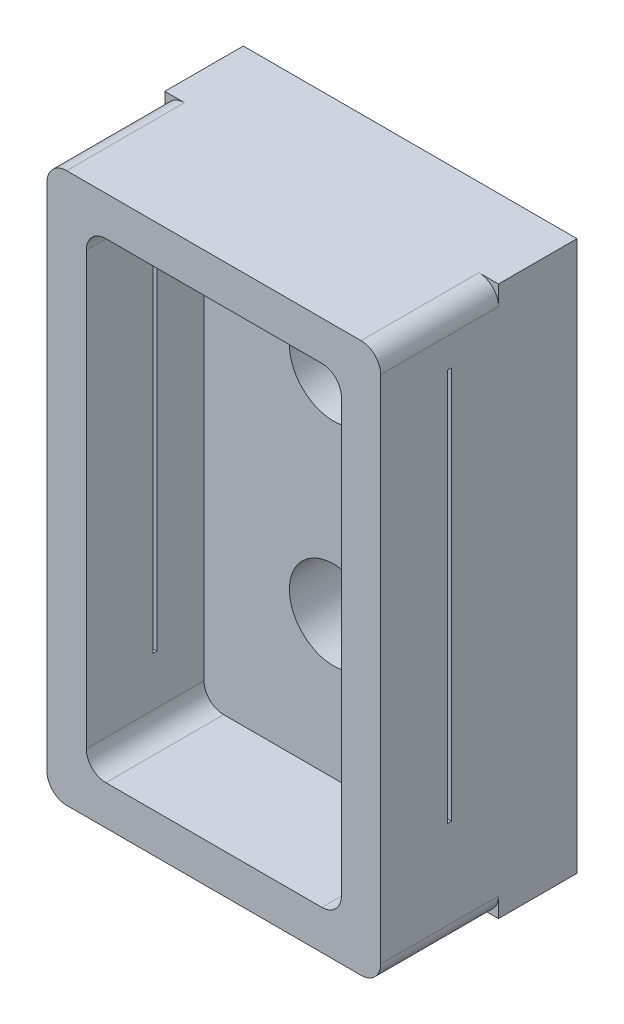
ISO-10303-21;
HEADER;
FILE_DESCRIPTION(('STEP AP214'),'2;1');
FILE_NAME('part.step','',(''),(''),'','','');
FILE_SCHEMA(('AUTOMOTIVE_DESIGN { 1 0 10303 214 1 1 1 1 }'));
ENDSEC;
DATA;
#1=APPLICATION_CONTEXT('core data for automotive mechanical design processes');
#2=APPLICATION_PROTOCOL_DEFINITION('international standard','automotive_design',2000,#1);
#3=PRODUCT_CONTEXT('',#1,'mechanical');
#4=PRODUCT('Part','Part','',(#3));
#5=PRODUCT_RELATED_PRODUCT_CATEGORY('part','',(#4));
#6=PRODUCT_DEFINITION_FORMATION('','',#4);
#7=PRODUCT_DEFINITION_CONTEXT('part definition',#1,'design');
#8=PRODUCT_DEFINITION('design','',#6,#7);
#9=PRODUCT_DEFINITION_SHAPE('','',#8);
#10=(LENGTH_UNIT() NAMED_UNIT(*) SI_UNIT(.MILLI.,.METRE.));
#11=(NAMED_UNIT(*) PLANE_ANGLE_UNIT() SI_UNIT($,.RADIAN.));
#12=(NAMED_UNIT(*) SI_UNIT($,.STERADIAN.) SOLID_ANGLE_UNIT());
#13=UNCERTAINTY_MEASURE_WITH_UNIT(LENGTH_MEASURE(1.E-05),#10,'distance_accuracy_value','');
#14=(GEOMETRIC_REPRESENTATION_CONTEXT(3) GLOBAL_UNCERTAINTY_ASSIGNED_CONTEXT((#13)) GLOBAL_UNIT_ASSIGNED_CONTEXT((#10,
#11,#12)) REPRESENTATION_CONTEXT('',''));
#15=CARTESIAN_POINT('',(0.,0.,0.));
#16=DIRECTION('',(0.,0.,1.));
#17=DIRECTION('',(1.,0.,0.));
#18=AXIS2_PLACEMENT_3D('',#15,#16,#17);
#19=CARTESIAN_POINT('',(-9.525,-20.291399463807,12.7));
#20=DIRECTION('',(1.,0.,0.));
#21=DIRECTION('',(0.,0.,-1.));
#22=AXIS2_PLACEMENT_3D('',#19,#20,#21);
#23=PLANE('',#22);
#24=DIRECTION('',(0.,0.,-1.));
#25=VECTOR('',#24,1.);
#26=CARTESIAN_POINT('',(-9.525,13.998600536193,12.7));
#27=LINE('',#26,#25);
#28=CARTESIAN_POINT('',(-9.525,13.998600536193,12.7));
#29=VERTEX_POINT('',#28);
#30=CARTESIAN_POINT('',(-9.525,13.998600536193,5.08));
#31=VERTEX_POINT('',#30);
#32=EDGE_CURVE('E377',#29,#31,#27,.T.);
#33=ORIENTED_EDGE('',*,*,#32,.T.);
#34=DIRECTION('',(0.,-1.,0.));
#35=VECTOR('',#34,1.);
#36=CARTESIAN_POINT('',(-9.525,-20.291399463807,5.08));
#37=LINE('',#36,#35);
#38=CARTESIAN_POINT('',(-9.525,15.268600536193,5.08));
#39=VERTEX_POINT('',#38);
#40=EDGE_CURVE('E241',#39,#31,#37,.T.);
#41=ORIENTED_EDGE('',*,*,#40,.F.);
#42=DIRECTION('',(0.,0.,-1.));
#43=VECTOR('',#42,1.);
#44=CARTESIAN_POINT('',(-9.525,15.268600536193,5.08));
#45=LINE('',#44,#43);
#46=CARTESIAN_POINT('',(-9.525,15.268600536193,0.));
#47=VERTEX_POINT('',#46);
#48=EDGE_CURVE('E610',#39,#47,#45,.T.);
#49=ORIENTED_EDGE('',*,*,#48,.T.);
#50=DIRECTION('',(0.,-1.,0.));
#51=VECTOR('',#50,1.);
#52=CARTESIAN_POINT('',(-9.525,-20.291399463807,0.));
#53=LINE('',#52,#51);
#54=CARTESIAN_POINT('',(-9.525,-20.291399463807,0.));
#55=VERTEX_POINT('',#54);
#56=EDGE_CURVE('E257',#47,#55,#53,.T.);
#57=ORIENTED_EDGE('',*,*,#56,.T.);
#58=DIRECTION('',(0.,0.,-1.));
#59=VECTOR('',#58,1.);
#60=CARTESIAN_POINT('',(-9.525,-20.291399463807,5.08));
#61=LINE('',#60,#59);
#62=CARTESIAN_POINT('',(-9.525,-20.291399463807,5.08));
#63=VERTEX_POINT('',#62);
#64=EDGE_CURVE('E247',#63,#55,#61,.T.);
#65=ORIENTED_EDGE('',*,*,#64,.F.);
#66=CARTESIAN_POINT('',(-9.525,-19.021399463807,5.08));
#67=VERTEX_POINT('',#66);
#68=EDGE_CURVE('E232',#67,#63,#37,.T.);
#69=ORIENTED_EDGE('',*,*,#68,.F.);
#70=DIRECTION('',(0.,0.,-1.));
#71=VECTOR('',#70,1.);
#72=CARTESIAN_POINT('',(-9.525,-19.021399463807,12.7));
#73=LINE('',#72,#71);
#74=CARTESIAN_POINT('',(-9.525,-19.021399463807,12.7));
#75=VERTEX_POINT('',#74);
#76=EDGE_CURVE('E379',#67,#75,#73,.F.);
#77=ORIENTED_EDGE('',*,*,#76,.T.);
#78=DIRECTION('',(0.,-1.,0.));
#79=VECTOR('',#78,1.);
#80=CARTESIAN_POINT('',(-9.525,-20.291399463807,12.7));
#81=LINE('',#80,#79);
#82=EDGE_CURVE('E352',#29,#75,#81,.T.);
#83=ORIENTED_EDGE('',*,*,#82,.F.);
#84=EDGE_LOOP('',(#33,#41,#49,#57,#65,#69,#77,#83));
#85=FACE_BOUND('',#84,.T.);
#86=DIRECTION('',(0.,-1.,0.));
#87=VECTOR('',#86,1.);
#88=CARTESIAN_POINT('',(-9.525,-20.291399463807,8.128));
#89=LINE('',#88,#87);
#90=CARTESIAN_POINT('',(-9.525,12.093600536193,8.128));
#91=VERTEX_POINT('',#90);
#92=CARTESIAN_POINT('',(-9.525,-13.306399463807,8.128));
#93=VERTEX_POINT('',#92);
#94=EDGE_CURVE('E271',#91,#93,#89,.T.);
#95=ORIENTED_EDGE('',*,*,#94,.F.);
#96=DIRECTION('',(0.,0.,-1.));
#97=VECTOR('',#96,1.);
#98=CARTESIAN_POINT('',(-9.525,12.093600536193,12.7));
#99=LINE('',#98,#97);
#100=CARTESIAN_POINT('',(-9.525,12.093600536193,8.382));
#101=VERTEX_POINT('',#100);
#102=EDGE_CURVE('E277',#101,#91,#99,.T.);
#103=ORIENTED_EDGE('',*,*,#102,.F.);
#104=DIRECTION('',(0.,1.,0.));
#105=VECTOR('',#104,1.);
#106=CARTESIAN_POINT('',(-9.525,-20.291399463807,8.382));
#107=LINE('',#106,#105);
#108=CARTESIAN_POINT('',(-9.525,-13.306399463807,8.382));
#109=VERTEX_POINT('',#108);
#110=EDGE_CURVE('E275',#109,#101,#107,.T.);
#111=ORIENTED_EDGE('',*,*,#110,.F.);
#112=DIRECTION('',(0.,0.,1.));
#113=VECTOR('',#112,1.);
#114=CARTESIAN_POINT('',(-9.525,-13.306399463807,12.7));
#115=LINE('',#114,#113);
#116=EDGE_CURVE('E273',#93,#109,#115,.T.);
#117=ORIENTED_EDGE('',*,*,#116,.F.);
#118=EDGE_LOOP('',(#95,#103,#111,#117));
#119=FACE_BOUND('',#118,.T.);
#120=ADVANCED_FACE('F37',(#85,#119),#23,.F.);
#121=CARTESIAN_POINT('',(12.065,-20.291399463807,12.7));
#122=DIRECTION('',(-1.,0.,0.));
#123=DIRECTION('',(0.,0.,1.));
#124=AXIS2_PLACEMENT_3D('',#121,#122,#123);
#125=PLANE('',#124);
#126=DIRECTION('',(0.,0.,-1.));
#127=VECTOR('',#126,1.);
#128=CARTESIAN_POINT('',(12.065,-19.021399463807,12.7));
#129=LINE('',#128,#127);
#130=CARTESIAN_POINT('',(12.065,-19.021399463807,12.7));
#131=VERTEX_POINT('',#130);
#132=CARTESIAN_POINT('',(12.065,-19.021399463807,5.08));
#133=VERTEX_POINT('',#132);
#134=EDGE_CURVE('E425',#131,#133,#129,.T.);
#135=ORIENTED_EDGE('',*,*,#134,.T.);
#136=DIRECTION('',(0.,1.,0.));
#137=VECTOR('',#136,1.);
#138=CARTESIAN_POINT('',(12.065,-20.291399463807,5.08));
#139=LINE('',#138,#137);
#140=CARTESIAN_POINT('',(12.065,-20.291399463807,5.08));
#141=VERTEX_POINT('',#140);
#142=EDGE_CURVE('E613',#141,#133,#139,.T.);
#143=ORIENTED_EDGE('',*,*,#142,.F.);
#144=DIRECTION('',(0.,0.,-1.));
#145=VECTOR('',#144,1.);
#146=CARTESIAN_POINT('',(12.065,-20.291399463807,5.08));
#147=LINE('',#146,#145);
#148=CARTESIAN_POINT('',(12.065,-20.291399463807,0.));
#149=VERTEX_POINT('',#148);
#150=EDGE_CURVE('E260',#141,#149,#147,.T.);
#151=ORIENTED_EDGE('',*,*,#150,.T.);
#152=DIRECTION('',(0.,1.,0.));
#153=VECTOR('',#152,1.);
#154=CARTESIAN_POINT('',(12.065,-20.291399463807,0.));
#155=LINE('',#154,#153);
#156=CARTESIAN_POINT('',(12.065,15.268600536193,0.));
#157=VERTEX_POINT('',#156);
#158=EDGE_CURVE('E369',#149,#157,#155,.T.);
#159=ORIENTED_EDGE('',*,*,#158,.T.);
#160=DIRECTION('',(0.,0.,-1.));
#161=VECTOR('',#160,1.);
#162=CARTESIAN_POINT('',(12.065,15.268600536193,5.08));
#163=LINE('',#162,#161);
#164=CARTESIAN_POINT('',(12.065,15.268600536193,5.08));
#165=VERTEX_POINT('',#164);
#166=EDGE_CURVE('E265',#165,#157,#163,.T.);
#167=ORIENTED_EDGE('',*,*,#166,.F.);
#168=CARTESIAN_POINT('',(12.065,13.998600536193,5.08));
#169=VERTEX_POINT('',#168);
#170=EDGE_CURVE('E251',#169,#165,#139,.T.);
#171=ORIENTED_EDGE('',*,*,#170,.F.);
#172=DIRECTION('',(0.,0.,-1.));
#173=VECTOR('',#172,1.);
#174=CARTESIAN_POINT('',(12.065,13.998600536193,12.7));
#175=LINE('',#174,#173);
#176=CARTESIAN_POINT('',(12.065,13.998600536193,12.7));
#177=VERTEX_POINT('',#176);
#178=EDGE_CURVE('E428',#169,#177,#175,.F.);
#179=ORIENTED_EDGE('',*,*,#178,.T.);
#180=DIRECTION('',(0.,1.,0.));
#181=VECTOR('',#180,1.);
#182=CARTESIAN_POINT('',(12.065,-20.291399463807,12.7));
#183=LINE('',#182,#181);
#184=EDGE_CURVE('E359',#131,#177,#183,.T.);
#185=ORIENTED_EDGE('',*,*,#184,.F.);
#186=EDGE_LOOP('',(#135,#143,#151,#159,#167,#171,#179,#185));
#187=FACE_BOUND('',#186,.T.);
#188=DIRECTION('',(0.,1.,0.));
#189=VECTOR('',#188,1.);
#190=CARTESIAN_POINT('',(12.065,-20.291399463807,8.128));
#191=LINE('',#190,#189);
#192=CARTESIAN_POINT('',(12.065,-13.306399463807,8.128));
#193=VERTEX_POINT('',#192);
#194=CARTESIAN_POINT('',(12.065,12.093600536193,8.128));
#195=VERTEX_POINT('',#194);
#196=EDGE_CURVE('E311',#193,#195,#191,.T.);
#197=ORIENTED_EDGE('',*,*,#196,.F.);
#198=DIRECTION('',(0.,0.,-1.));
#199=VECTOR('',#198,1.);
#200=CARTESIAN_POINT('',(12.065,-13.306399463807,12.7));
#201=LINE('',#200,#199);
#202=CARTESIAN_POINT('',(12.065,-13.306399463807,8.382));
#203=VERTEX_POINT('',#202);
#204=EDGE_CURVE('E316',#203,#193,#201,.T.);
#205=ORIENTED_EDGE('',*,*,#204,.F.);
#206=DIRECTION('',(0.,-1.,0.));
#207=VECTOR('',#206,1.);
#208=CARTESIAN_POINT('',(12.065,-20.291399463807,8.382));
#209=LINE('',#208,#207);
#210=CARTESIAN_POINT('',(12.065,12.093600536193,8.382));
#211=VERTEX_POINT('',#210);
#212=EDGE_CURVE('E303',#211,#203,#209,.T.);
#213=ORIENTED_EDGE('',*,*,#212,.F.);
#214=DIRECTION('',(0.,0.,1.));
#215=VECTOR('',#214,1.);
#216=CARTESIAN_POINT('',(12.065,12.093600536193,12.7));
#217=LINE('',#216,#215);
#218=EDGE_CURVE('E294',#195,#211,#217,.T.);
#219=ORIENTED_EDGE('',*,*,#218,.F.);
#220=EDGE_LOOP('',(#197,#205,#213,#219));
#221=FACE_BOUND('',#220,.T.);
#222=ADVANCED_FACE('F472',(#187,#221),#125,.F.);
#223=CARTESIAN_POINT('',(-6.985,-17.751399463807,5.08));
#224=DIRECTION('',(-1.,0.,0.));
#225=DIRECTION('',(0.,0.,1.));
#226=AXIS2_PLACEMENT_3D('',#223,#224,#225);
#227=PLANE('',#226);
#228=DIRECTION('',(0.,1.,0.));
#229=VECTOR('',#228,1.);
#230=CARTESIAN_POINT('',(-6.985,-17.751399463807,8.128));
#231=LINE('',#230,#229);
#232=CARTESIAN_POINT('',(-6.985,-13.306399463807,8.128));
#233=VERTEX_POINT('',#232);
#234=CARTESIAN_POINT('',(-6.985,11.458600536193,8.128));
#235=VERTEX_POINT('',#234);
#236=EDGE_CURVE('E305',#233,#235,#231,.T.);
#237=ORIENTED_EDGE('',*,*,#236,.F.);
#238=DIRECTION('',(0.,0.,-1.));
#239=VECTOR('',#238,1.);
#240=CARTESIAN_POINT('',(-6.985,-13.306399463807,5.08));
#241=LINE('',#240,#239);
#242=CARTESIAN_POINT('',(-6.985,-13.306399463807,8.382));
#243=VERTEX_POINT('',#242);
#244=EDGE_CURVE('E314',#243,#233,#241,.T.);
#245=ORIENTED_EDGE('',*,*,#244,.F.);
#246=DIRECTION('',(0.,-1.,0.));
#247=VECTOR('',#246,1.);
#248=CARTESIAN_POINT('',(-6.985,-17.751399463807,8.382));
#249=LINE('',#248,#247);
#250=CARTESIAN_POINT('',(-6.985,11.458600536193,8.382));
#251=VERTEX_POINT('',#250);
#252=EDGE_CURVE('E296',#251,#243,#249,.T.);
#253=ORIENTED_EDGE('',*,*,#252,.F.);
#254=DIRECTION('',(0.,0.,1.));
#255=VECTOR('',#254,1.);
#256=CARTESIAN_POINT('',(-6.985,11.458600536193,12.7));
#257=LINE('',#256,#255);
#258=CARTESIAN_POINT('',(-6.985,11.458600536193,12.7));
#259=VERTEX_POINT('',#258);
#260=EDGE_CURVE('E419',#251,#259,#257,.T.);
#261=ORIENTED_EDGE('',*,*,#260,.T.);
#262=DIRECTION('',(0.,-1.,0.));
#263=VECTOR('',#262,1.);
#264=CARTESIAN_POINT('',(-6.985,-17.751399463807,12.7));
#265=LINE('',#264,#263);
#266=CARTESIAN_POINT('',(-6.985,-16.481399463807,12.7));
#267=VERTEX_POINT('',#266);
#268=EDGE_CURVE('E318',#259,#267,#265,.T.);
#269=ORIENTED_EDGE('',*,*,#268,.T.);
#270=DIRECTION('',(0.,0.,1.));
#271=VECTOR('',#270,1.);
#272=CARTESIAN_POINT('',(-6.985,-16.481399463807,5.08));
#273=LINE('',#272,#271);
#274=CARTESIAN_POINT('',(-6.985,-16.481399463807,5.08));
#275=VERTEX_POINT('',#274);
#276=EDGE_CURVE('E423',#267,#275,#273,.F.);
#277=ORIENTED_EDGE('',*,*,#276,.T.);
#278=DIRECTION('',(0.,-1.,0.));
#279=VECTOR('',#278,1.);
#280=CARTESIAN_POINT('',(-6.985,-17.751399463807,5.08));
#281=LINE('',#280,#279);
#282=CARTESIAN_POINT('',(-6.985,11.458600536193,5.08));
#283=VERTEX_POINT('',#282);
#284=EDGE_CURVE('E319',#283,#275,#281,.T.);
#285=ORIENTED_EDGE('',*,*,#284,.F.);
#286=EDGE_CURVE('E420',#283,#235,#257,.T.);
#287=ORIENTED_EDGE('',*,*,#286,.T.);
#288=EDGE_LOOP('',(#237,#245,#253,#261,#269,#277,#285,#287));
#289=FACE_BOUND('',#288,.T.);
#290=ADVANCED_FACE('F497',(#289),#227,.F.);
#291=CARTESIAN_POINT('',(9.525,-17.751399463807,5.08));
#292=DIRECTION('',(1.,0.,0.));
#293=DIRECTION('',(0.,0.,-1.));
#294=AXIS2_PLACEMENT_3D('',#291,#292,#293);
#295=PLANE('',#294);
#296=DIRECTION('',(0.,-1.,0.));
#297=VECTOR('',#296,1.);
#298=CARTESIAN_POINT('',(9.525,-17.751399463807,8.128));
#299=LINE('',#298,#297);
#300=CARTESIAN_POINT('',(9.525,11.458600536193,8.128));
#301=VERTEX_POINT('',#300);
#302=CARTESIAN_POINT('',(9.525,-13.306399463807,8.128));
#303=VERTEX_POINT('',#302);
#304=EDGE_CURVE('E309',#301,#303,#299,.T.);
#305=ORIENTED_EDGE('',*,*,#304,.F.);
#306=DIRECTION('',(0.,0.,1.));
#307=VECTOR('',#306,1.);
#308=CARTESIAN_POINT('',(9.525,11.458600536193,5.08));
#309=LINE('',#308,#307);
#310=CARTESIAN_POINT('',(9.525,11.458600536193,5.08));
#311=VERTEX_POINT('',#310);
#312=EDGE_CURVE('E402',#301,#311,#309,.F.);
#313=ORIENTED_EDGE('',*,*,#312,.T.);
#314=DIRECTION('',(0.,1.,0.));
#315=VECTOR('',#314,1.);
#316=CARTESIAN_POINT('',(9.525,-17.751399463807,5.08));
#317=LINE('',#316,#315);
#318=CARTESIAN_POINT('',(9.525,-16.481399463807,5.08));
#319=VERTEX_POINT('',#318);
#320=EDGE_CURVE('E326',#319,#311,#317,.T.);
#321=ORIENTED_EDGE('',*,*,#320,.F.);
#322=DIRECTION('',(0.,0.,1.));
#323=VECTOR('',#322,1.);
#324=CARTESIAN_POINT('',(9.525,-16.481399463807,12.7));
#325=LINE('',#324,#323);
#326=CARTESIAN_POINT('',(9.525,-16.481399463807,12.7));
#327=VERTEX_POINT('',#326);
#328=EDGE_CURVE('E399',#319,#327,#325,.T.);
#329=ORIENTED_EDGE('',*,*,#328,.T.);
#330=DIRECTION('',(0.,1.,0.));
#331=VECTOR('',#330,1.);
#332=CARTESIAN_POINT('',(9.525,-17.751399463807,12.7));
#333=LINE('',#332,#331);
#334=CARTESIAN_POINT('',(9.525,11.458600536193,12.7));
#335=VERTEX_POINT('',#334);
#336=EDGE_CURVE('E338',#327,#335,#333,.T.);
#337=ORIENTED_EDGE('',*,*,#336,.T.);
#338=CARTESIAN_POINT('',(9.525,11.458600536193,8.382));
#339=VERTEX_POINT('',#338);
#340=EDGE_CURVE('E403',#335,#339,#309,.F.);
#341=ORIENTED_EDGE('',*,*,#340,.T.);
#342=DIRECTION('',(0.,1.,0.));
#343=VECTOR('',#342,1.);
#344=CARTESIAN_POINT('',(9.525,-17.751399463807,8.382));
#345=LINE('',#344,#343);
#346=CARTESIAN_POINT('',(9.525,-13.306399463807,8.382));
#347=VERTEX_POINT('',#346);
#348=EDGE_CURVE('E301',#347,#339,#345,.T.);
#349=ORIENTED_EDGE('',*,*,#348,.F.);
#350=DIRECTION('',(0.,0.,1.));
#351=VECTOR('',#350,1.);
#352=CARTESIAN_POINT('',(9.525,-13.306399463807,5.08));
#353=LINE('',#352,#351);
#354=EDGE_CURVE('E45',#303,#347,#353,.T.);
#355=ORIENTED_EDGE('',*,*,#354,.F.);
#356=EDGE_LOOP('',(#305,#313,#321,#329,#337,#341,#349,#355));
#357=FACE_BOUND('',#356,.T.);
#358=ADVANCED_FACE('F460',(#357),#295,.F.);
#359=CARTESIAN_POINT('',(8.255,11.458600536193,5.08));
#360=DIRECTION('',(0.,0.,-1.));
#361=DIRECTION('',(-1.,0.,0.));
#362=AXIS2_PLACEMENT_3D('',#359,#360,#361);
#363=CYLINDRICAL_SURFACE('',#362,1.27);
#364=CARTESIAN_POINT('',(8.255,11.458600536193,8.128));
#365=DIRECTION('',(0.,0.,1.));
#366=DIRECTION('',(1.,0.,0.));
#367=AXIS2_PLACEMENT_3D('',#364,#365,#366);
#368=CIRCLE('',#367,1.27);
#369=CARTESIAN_POINT('',(9.35485226280624,12.093600536193,8.128));
#370=VERTEX_POINT('',#369);
#371=EDGE_CURVE('E307',#370,#301,#368,.F.);
#372=ORIENTED_EDGE('',*,*,#371,.F.);
#373=DIRECTION('',(0.,0.,-1.));
#374=VECTOR('',#373,1.);
#375=CARTESIAN_POINT('',(9.35485226280623,12.093600536193,5.08));
#376=LINE('',#375,#374);
#377=CARTESIAN_POINT('',(9.35485226280623,12.093600536193,8.382));
#378=VERTEX_POINT('',#377);
#379=EDGE_CURVE('E292',#378,#370,#376,.T.);
#380=ORIENTED_EDGE('',*,*,#379,.F.);
#381=CARTESIAN_POINT('',(8.255,11.458600536193,8.382));
#382=DIRECTION('',(0.,0.,-1.));
#383=DIRECTION('',(-1.,0.,0.));
#384=AXIS2_PLACEMENT_3D('',#381,#382,#383);
#385=CIRCLE('',#384,1.27);
#386=EDGE_CURVE('E298',#339,#378,#385,.F.);
#387=ORIENTED_EDGE('',*,*,#386,.F.);
#388=ORIENTED_EDGE('',*,*,#340,.F.);
#389=CARTESIAN_POINT('',(8.255,11.458600536193,12.7));
#390=DIRECTION('',(0.,0.,1.));
#391=DIRECTION('',(1.,0.,0.));
#392=AXIS2_PLACEMENT_3D('',#389,#390,#391);
#393=CIRCLE('',#392,1.27);
#394=CARTESIAN_POINT('',(8.255,12.728600536193,12.7));
#395=VERTEX_POINT('',#394);
#396=EDGE_CURVE('E430',#395,#335,#393,.F.);
#397=ORIENTED_EDGE('',*,*,#396,.F.);
#398=DIRECTION('',(0.,0.,1.));
#399=VECTOR('',#398,1.);
#400=CARTESIAN_POINT('',(8.255,12.728600536193,12.7));
#401=LINE('',#400,#399);
#402=CARTESIAN_POINT('',(8.255,12.728600536193,5.08));
#403=VERTEX_POINT('',#402);
#404=EDGE_CURVE('E396',#403,#395,#401,.T.);
#405=ORIENTED_EDGE('',*,*,#404,.F.);
#406=CARTESIAN_POINT('',(8.255,11.458600536193,5.08));
#407=DIRECTION('',(0.,0.,1.));
#408=DIRECTION('',(1.,0.,0.));
#409=AXIS2_PLACEMENT_3D('',#406,#407,#408);
#410=CIRCLE('',#409,1.27);
#411=EDGE_CURVE('E412',#311,#403,#410,.T.);
#412=ORIENTED_EDGE('',*,*,#411,.F.);
#413=ORIENTED_EDGE('',*,*,#312,.F.);
#414=EDGE_LOOP('',(#372,#380,#387,#388,#397,#405,#412,#413));
#415=FACE_BOUND('',#414,.T.);
#416=ADVANCED_FACE('F465',(#415),#363,.F.);
#417=CARTESIAN_POINT('',(-5.715,11.458600536193,5.08));
#418=DIRECTION('',(0.,0.,-1.));
#419=DIRECTION('',(-1.,0.,0.));
#420=AXIS2_PLACEMENT_3D('',#417,#418,#419);
#421=CYLINDRICAL_SURFACE('',#420,1.27);
#422=CARTESIAN_POINT('',(-5.715,11.458600536193,8.128));
#423=DIRECTION('',(0.,0.,1.));
#424=DIRECTION('',(1.,0.,0.));
#425=AXIS2_PLACEMENT_3D('',#422,#423,#424);
#426=CIRCLE('',#425,1.27);
#427=CARTESIAN_POINT('',(-6.81485226280624,12.093600536193,8.128));
#428=VERTEX_POINT('',#427);
#429=EDGE_CURVE('E442',#235,#428,#426,.F.);
#430=ORIENTED_EDGE('',*,*,#429,.F.);
#431=ORIENTED_EDGE('',*,*,#286,.F.);
#432=CARTESIAN_POINT('',(-5.715,11.458600536193,5.08));
#433=DIRECTION('',(0.,0.,1.));
#434=DIRECTION('',(1.,0.,0.));
#435=AXIS2_PLACEMENT_3D('',#432,#433,#434);
#436=CIRCLE('',#435,1.27);
#437=CARTESIAN_POINT('',(-5.715,12.728600536193,5.08));
#438=VERTEX_POINT('',#437);
#439=EDGE_CURVE('E406',#438,#283,#436,.T.);
#440=ORIENTED_EDGE('',*,*,#439,.F.);
#441=DIRECTION('',(0.,0.,1.));
#442=VECTOR('',#441,1.);
#443=CARTESIAN_POINT('',(-5.715,12.728600536193,5.08));
#444=LINE('',#443,#442);
#445=CARTESIAN_POINT('',(-5.715,12.728600536193,12.7));
#446=VERTEX_POINT('',#445);
#447=EDGE_CURVE('E394',#446,#438,#444,.F.);
#448=ORIENTED_EDGE('',*,*,#447,.F.);
#449=CARTESIAN_POINT('',(-5.715,11.458600536193,12.7));
#450=DIRECTION('',(0.,0.,1.));
#451=DIRECTION('',(1.,0.,0.));
#452=AXIS2_PLACEMENT_3D('',#449,#450,#451);
#453=CIRCLE('',#452,1.27);
#454=EDGE_CURVE('E436',#259,#446,#453,.F.);
#455=ORIENTED_EDGE('',*,*,#454,.F.);
#456=ORIENTED_EDGE('',*,*,#260,.F.);
#457=CARTESIAN_POINT('',(-5.715,11.458600536193,8.382));
#458=DIRECTION('',(0.,0.,-1.));
#459=DIRECTION('',(-1.,0.,0.));
#460=AXIS2_PLACEMENT_3D('',#457,#458,#459);
#461=CIRCLE('',#460,1.27);
#462=CARTESIAN_POINT('',(-6.81485226280624,12.093600536193,8.382));
#463=VERTEX_POINT('',#462);
#464=EDGE_CURVE('E440',#463,#251,#461,.F.);
#465=ORIENTED_EDGE('',*,*,#464,.F.);
#466=DIRECTION('',(0.,0.,-1.));
#467=VECTOR('',#466,1.);
#468=CARTESIAN_POINT('',(-6.81485226280624,12.093600536193,5.08));
#469=LINE('',#468,#467);
#470=EDGE_CURVE('E438',#428,#463,#469,.F.);
#471=ORIENTED_EDGE('',*,*,#470,.F.);
#472=EDGE_LOOP('',(#430,#431,#440,#448,#455,#456,#465,#471));
#473=FACE_BOUND('',#472,.T.);
#474=ADVANCED_FACE('F39',(#473),#421,.F.);
#475=CARTESIAN_POINT('',(1.397,5.10860053619303,12.7));
#476=DIRECTION('',(0.,0.,-1.));
#477=DIRECTION('',(-1.,0.,0.));
#478=AXIS2_PLACEMENT_3D('',#475,#476,#477);
#479=CYLINDRICAL_SURFACE('',#478,2.8575);
#480=CARTESIAN_POINT('',(1.397,5.10860053619303,0.));
#481=DIRECTION('',(0.,0.,1.));
#482=DIRECTION('',(1.,0.,0.));
#483=AXIS2_PLACEMENT_3D('',#480,#481,#482);
#484=CIRCLE('',#483,2.8575);
#485=CARTESIAN_POINT('',(4.2545,5.10860053619303,0.));
#486=VERTEX_POINT('',#485);
#487=EDGE_CURVE('E349',#486,#486,#484,.T.);
#488=ORIENTED_EDGE('',*,*,#487,.F.);
#489=EDGE_LOOP('',(#488));
#490=FACE_BOUND('',#489,.T.);
#491=CARTESIAN_POINT('',(1.397,5.10860053619303,5.08));
#492=DIRECTION('',(0.,0.,1.));
#493=DIRECTION('',(1.,0.,0.));
#494=AXIS2_PLACEMENT_3D('',#491,#492,#493);
#495=CIRCLE('',#494,2.8575);
#496=CARTESIAN_POINT('',(4.2545,5.10860053619303,5.08));
#497=VERTEX_POINT('',#496);
#498=EDGE_CURVE('E343',#497,#497,#495,.T.);
#499=ORIENTED_EDGE('',*,*,#498,.T.);
#500=EDGE_LOOP('',(#499));
#501=FACE_BOUND('',#500,.T.);
#502=ADVANCED_FACE('F551',(#490,#501),#479,.F.);
#503=CARTESIAN_POINT('',(1.397,-8.60739946380697,12.7));
#504=DIRECTION('',(0.,0.,-1.));
#505=DIRECTION('',(-1.,0.,0.));
#506=AXIS2_PLACEMENT_3D('',#503,#504,#505);
#507=CYLINDRICAL_SURFACE('',#506,2.8575);
#508=CARTESIAN_POINT('',(1.397,-8.60739946380697,0.));
#509=DIRECTION('',(0.,0.,1.));
#510=DIRECTION('',(1.,0.,0.));
#511=AXIS2_PLACEMENT_3D('',#508,#509,#510);
#512=CIRCLE('',#511,2.8575);
#513=CARTESIAN_POINT('',(4.2545,-8.60739946380697,0.));
#514=VERTEX_POINT('',#513);
#515=EDGE_CURVE('E346',#514,#514,#512,.T.);
#516=ORIENTED_EDGE('',*,*,#515,.F.);
#517=EDGE_LOOP('',(#516));
#518=FACE_BOUND('',#517,.T.);
#519=CARTESIAN_POINT('',(1.397,-8.60739946380697,5.08));
#520=DIRECTION('',(0.,0.,1.));
#521=DIRECTION('',(1.,0.,0.));
#522=AXIS2_PLACEMENT_3D('',#519,#520,#521);
#523=CIRCLE('',#522,2.8575);
#524=CARTESIAN_POINT('',(4.2545,-8.60739946380697,5.08));
#525=VERTEX_POINT('',#524);
#526=EDGE_CURVE('E332',#525,#525,#523,.T.);
#527=ORIENTED_EDGE('',*,*,#526,.T.);
#528=EDGE_LOOP('',(#527));
#529=FACE_BOUND('',#528,.T.);
#530=ADVANCED_FACE('F516',(#518,#529),#507,.F.);
#531=CARTESIAN_POINT('',(0.,0.,12.7));
#532=DIRECTION('',(0.,0.,1.));
#533=DIRECTION('',(1.,0.,0.));
#534=AXIS2_PLACEMENT_3D('',#531,#532,#533);
#535=PLANE('',#534);
#536=ORIENTED_EDGE('',*,*,#268,.F.);
#537=ORIENTED_EDGE('',*,*,#454,.T.);
#538=DIRECTION('',(-1.,0.,0.));
#539=VECTOR('',#538,1.);
#540=CARTESIAN_POINT('',(9.525,12.728600536193,12.7));
#541=LINE('',#540,#539);
#542=EDGE_CURVE('E323',#395,#446,#541,.T.);
#543=ORIENTED_EDGE('',*,*,#542,.F.);
#544=ORIENTED_EDGE('',*,*,#396,.T.);
#545=ORIENTED_EDGE('',*,*,#336,.F.);
#546=CARTESIAN_POINT('',(8.255,-16.481399463807,12.7));
#547=DIRECTION('',(0.,0.,1.));
#548=DIRECTION('',(1.,0.,0.));
#549=AXIS2_PLACEMENT_3D('',#546,#547,#548);
#550=CIRCLE('',#549,1.27);
#551=CARTESIAN_POINT('',(8.255,-17.751399463807,12.7));
#552=VERTEX_POINT('',#551);
#553=EDGE_CURVE('E432',#327,#552,#550,.F.);
#554=ORIENTED_EDGE('',*,*,#553,.T.);
#555=DIRECTION('',(1.,0.,0.));
#556=VECTOR('',#555,1.);
#557=CARTESIAN_POINT('',(9.525,-17.751399463807,12.7));
#558=LINE('',#557,#556);
#559=CARTESIAN_POINT('',(-5.715,-17.751399463807,12.7));
#560=VERTEX_POINT('',#559);
#561=EDGE_CURVE('E335',#560,#552,#558,.T.);
#562=ORIENTED_EDGE('',*,*,#561,.F.);
#563=CARTESIAN_POINT('',(-5.715,-16.481399463807,12.7));
#564=DIRECTION('',(0.,0.,1.));
#565=DIRECTION('',(1.,0.,0.));
#566=AXIS2_PLACEMENT_3D('',#563,#564,#565);
#567=CIRCLE('',#566,1.27);
#568=EDGE_CURVE('E434',#560,#267,#567,.F.);
#569=ORIENTED_EDGE('',*,*,#568,.T.);
#570=EDGE_LOOP('',(#536,#537,#543,#544,#545,#554,#562,#569));
#571=FACE_BOUND('',#570,.T.);
#572=ORIENTED_EDGE('',*,*,#82,.T.);
#573=CARTESIAN_POINT('',(-8.255,-19.021399463807,12.7));
#574=DIRECTION('',(0.,0.,1.));
#575=DIRECTION('',(1.,0.,0.));
#576=AXIS2_PLACEMENT_3D('',#573,#574,#575);
#577=CIRCLE('',#576,1.27);
#578=CARTESIAN_POINT('',(-8.255,-20.291399463807,12.7));
#579=VERTEX_POINT('',#578);
#580=EDGE_CURVE('E387',#75,#579,#577,.T.);
#581=ORIENTED_EDGE('',*,*,#580,.T.);
#582=DIRECTION('',(1.,0.,0.));
#583=VECTOR('',#582,1.);
#584=CARTESIAN_POINT('',(12.065,-20.291399463807,12.7));
#585=LINE('',#584,#583);
#586=CARTESIAN_POINT('',(10.795,-20.291399463807,12.7));
#587=VERTEX_POINT('',#586);
#588=EDGE_CURVE('E355',#579,#587,#585,.T.);
#589=ORIENTED_EDGE('',*,*,#588,.T.);
#590=CARTESIAN_POINT('',(10.795,-19.021399463807,12.7));
#591=DIRECTION('',(0.,0.,1.));
#592=DIRECTION('',(1.,0.,0.));
#593=AXIS2_PLACEMENT_3D('',#590,#591,#592);
#594=CIRCLE('',#593,1.27);
#595=EDGE_CURVE('E381',#587,#131,#594,.T.);
#596=ORIENTED_EDGE('',*,*,#595,.T.);
#597=ORIENTED_EDGE('',*,*,#184,.T.);
#598=CARTESIAN_POINT('',(10.795,13.998600536193,12.7));
#599=DIRECTION('',(0.,0.,1.));
#600=DIRECTION('',(1.,0.,0.));
#601=AXIS2_PLACEMENT_3D('',#598,#599,#600);
#602=CIRCLE('',#601,1.27);
#603=CARTESIAN_POINT('',(10.795,15.268600536193,12.7));
#604=VERTEX_POINT('',#603);
#605=EDGE_CURVE('E383',#177,#604,#602,.T.);
#606=ORIENTED_EDGE('',*,*,#605,.T.);
#607=DIRECTION('',(-1.,0.,0.));
#608=VECTOR('',#607,1.);
#609=CARTESIAN_POINT('',(12.065,15.268600536193,12.7));
#610=LINE('',#609,#608);
#611=CARTESIAN_POINT('',(-8.255,15.268600536193,12.7));
#612=VERTEX_POINT('',#611);
#613=EDGE_CURVE('E362',#604,#612,#610,.T.);
#614=ORIENTED_EDGE('',*,*,#613,.T.);
#615=CARTESIAN_POINT('',(-8.255,13.998600536193,12.7));
#616=DIRECTION('',(0.,0.,1.));
#617=DIRECTION('',(1.,0.,0.));
#618=AXIS2_PLACEMENT_3D('',#615,#616,#617);
#619=CIRCLE('',#618,1.27);
#620=EDGE_CURVE('E385',#612,#29,#619,.T.);
#621=ORIENTED_EDGE('',*,*,#620,.T.);
#622=EDGE_LOOP('',(#572,#581,#589,#596,#597,#606,#614,#621));
#623=FACE_BOUND('',#622,.T.);
#624=ADVANCED_FACE('F512',(#571,#623),#535,.T.);
#625=CARTESIAN_POINT('',(0.,0.,0.));
#626=DIRECTION('',(0.,0.,1.));
#627=DIRECTION('',(1.,0.,0.));
#628=AXIS2_PLACEMENT_3D('',#625,#626,#627);
#629=PLANE('',#628);
#630=DIRECTION('',(1.,0.,0.));
#631=VECTOR('',#630,1.);
#632=CARTESIAN_POINT('',(12.065,-20.291399463807,0.));
#633=LINE('',#632,#631);
#634=EDGE_CURVE('E367',#55,#149,#633,.T.);
#635=ORIENTED_EDGE('',*,*,#634,.F.);
#636=ORIENTED_EDGE('',*,*,#56,.F.);
#637=DIRECTION('',(-1.,0.,0.));
#638=VECTOR('',#637,1.);
#639=CARTESIAN_POINT('',(12.065,15.268600536193,0.));
#640=LINE('',#639,#638);
#641=EDGE_CURVE('E356',#157,#47,#640,.T.);
#642=ORIENTED_EDGE('',*,*,#641,.F.);
#643=ORIENTED_EDGE('',*,*,#158,.F.);
#644=EDGE_LOOP('',(#635,#636,#642,#643));
#645=FACE_BOUND('',#644,.T.);
#646=ORIENTED_EDGE('',*,*,#487,.T.);
#647=EDGE_LOOP('',(#646));
#648=FACE_BOUND('',#647,.T.);
#649=ORIENTED_EDGE('',*,*,#515,.T.);
#650=EDGE_LOOP('',(#649));
#651=FACE_BOUND('',#650,.T.);
#652=ADVANCED_FACE('F515',(#645,#648,#651),#629,.F.);
#653=CARTESIAN_POINT('',(12.065,-20.291399463807,12.7));
#654=DIRECTION('',(0.,1.,0.));
#655=DIRECTION('',(-1.,0.,0.));
#656=AXIS2_PLACEMENT_3D('',#653,#654,#655);
#657=PLANE('',#656);
#658=DIRECTION('',(0.,0.,-1.));
#659=VECTOR('',#658,1.);
#660=CARTESIAN_POINT('',(-8.255,-20.291399463807,12.7));
#661=LINE('',#660,#659);
#662=CARTESIAN_POINT('',(-8.255,-20.291399463807,5.08));
#663=VERTEX_POINT('',#662);
#664=EDGE_CURVE('E250',#579,#663,#661,.T.);
#665=ORIENTED_EDGE('',*,*,#664,.T.);
#666=DIRECTION('',(1.,0.,0.));
#667=VECTOR('',#666,1.);
#668=CARTESIAN_POINT('',(12.065,-20.291399463807,5.08));
#669=LINE('',#668,#667);
#670=EDGE_CURVE('E235',#63,#663,#669,.T.);
#671=ORIENTED_EDGE('',*,*,#670,.F.);
#672=ORIENTED_EDGE('',*,*,#64,.T.);
#673=ORIENTED_EDGE('',*,*,#634,.T.);
#674=ORIENTED_EDGE('',*,*,#150,.F.);
#675=CARTESIAN_POINT('',(10.795,-20.291399463807,5.08));
#676=VERTEX_POINT('',#675);
#677=EDGE_CURVE('E252',#676,#141,#669,.T.);
#678=ORIENTED_EDGE('',*,*,#677,.F.);
#679=DIRECTION('',(0.,0.,-1.));
#680=VECTOR('',#679,1.);
#681=CARTESIAN_POINT('',(10.795,-20.291399463807,12.7));
#682=LINE('',#681,#680);
#683=EDGE_CURVE('E365',#676,#587,#682,.F.);
#684=ORIENTED_EDGE('',*,*,#683,.T.);
#685=ORIENTED_EDGE('',*,*,#588,.F.);
#686=EDGE_LOOP('',(#665,#671,#672,#673,#674,#678,#684,#685));
#687=FACE_BOUND('',#686,.T.);
#688=ADVANCED_FACE('F246',(#687),#657,.F.);
#689=CARTESIAN_POINT('',(12.065,15.268600536193,12.7));
#690=DIRECTION('',(0.,-1.,0.));
#691=DIRECTION('',(1.,0.,0.));
#692=AXIS2_PLACEMENT_3D('',#689,#690,#691);
#693=PLANE('',#692);
#694=DIRECTION('',(0.,0.,-1.));
#695=VECTOR('',#694,1.);
#696=CARTESIAN_POINT('',(10.795,15.268600536193,12.7));
#697=LINE('',#696,#695);
#698=CARTESIAN_POINT('',(10.795,15.268600536193,5.08));
#699=VERTEX_POINT('',#698);
#700=EDGE_CURVE('E389',#604,#699,#697,.T.);
#701=ORIENTED_EDGE('',*,*,#700,.T.);
#702=DIRECTION('',(-1.,0.,0.));
#703=VECTOR('',#702,1.);
#704=CARTESIAN_POINT('',(12.065,15.268600536193,5.08));
#705=LINE('',#704,#703);
#706=EDGE_CURVE('E608',#165,#699,#705,.T.);
#707=ORIENTED_EDGE('',*,*,#706,.F.);
#708=ORIENTED_EDGE('',*,*,#166,.T.);
#709=ORIENTED_EDGE('',*,*,#641,.T.);
#710=ORIENTED_EDGE('',*,*,#48,.F.);
#711=CARTESIAN_POINT('',(-8.255,15.268600536193,5.08));
#712=VERTEX_POINT('',#711);
#713=EDGE_CURVE('E52',#712,#39,#705,.T.);
#714=ORIENTED_EDGE('',*,*,#713,.F.);
#715=DIRECTION('',(0.,0.,-1.));
#716=VECTOR('',#715,1.);
#717=CARTESIAN_POINT('',(-8.255,15.268600536193,12.7));
#718=LINE('',#717,#716);
#719=EDGE_CURVE('E392',#712,#612,#718,.F.);
#720=ORIENTED_EDGE('',*,*,#719,.T.);
#721=ORIENTED_EDGE('',*,*,#613,.F.);
#722=EDGE_LOOP('',(#701,#707,#708,#709,#710,#714,#720,#721));
#723=FACE_BOUND('',#722,.T.);
#724=ADVANCED_FACE('F544',(#723),#693,.F.);
#725=CARTESIAN_POINT('',(9.525,12.728600536193,5.08));
#726=DIRECTION('',(0.,1.,0.));
#727=DIRECTION('',(-1.,0.,0.));
#728=AXIS2_PLACEMENT_3D('',#725,#726,#727);
#729=PLANE('',#728);
#730=DIRECTION('',(-1.,0.,0.));
#731=VECTOR('',#730,1.);
#732=CARTESIAN_POINT('',(9.525,12.728600536193,5.08));
#733=LINE('',#732,#731);
#734=EDGE_CURVE('E329',#403,#438,#733,.T.);
#735=ORIENTED_EDGE('',*,*,#734,.F.);
#736=ORIENTED_EDGE('',*,*,#404,.T.);
#737=ORIENTED_EDGE('',*,*,#542,.T.);
#738=ORIENTED_EDGE('',*,*,#447,.T.);
#739=EDGE_LOOP('',(#735,#736,#737,#738));
#740=FACE_BOUND('',#739,.T.);
#741=ADVANCED_FACE('F484',(#740),#729,.F.);
#742=CARTESIAN_POINT('',(9.525,-17.751399463807,5.08));
#743=DIRECTION('',(0.,-1.,0.));
#744=DIRECTION('',(1.,0.,0.));
#745=AXIS2_PLACEMENT_3D('',#742,#743,#744);
#746=PLANE('',#745);
#747=ORIENTED_EDGE('',*,*,#561,.T.);
#748=DIRECTION('',(0.,0.,1.));
#749=VECTOR('',#748,1.);
#750=CARTESIAN_POINT('',(8.255,-17.751399463807,5.08));
#751=LINE('',#750,#749);
#752=CARTESIAN_POINT('',(8.255,-17.751399463807,5.08));
#753=VERTEX_POINT('',#752);
#754=EDGE_CURVE('E417',#552,#753,#751,.F.);
#755=ORIENTED_EDGE('',*,*,#754,.T.);
#756=DIRECTION('',(1.,0.,0.));
#757=VECTOR('',#756,1.);
#758=CARTESIAN_POINT('',(9.525,-17.751399463807,5.08));
#759=LINE('',#758,#757);
#760=CARTESIAN_POINT('',(-5.715,-17.751399463807,5.08));
#761=VERTEX_POINT('',#760);
#762=EDGE_CURVE('E322',#761,#753,#759,.T.);
#763=ORIENTED_EDGE('',*,*,#762,.F.);
#764=DIRECTION('',(0.,0.,1.));
#765=VECTOR('',#764,1.);
#766=CARTESIAN_POINT('',(-5.715,-17.751399463807,12.7));
#767=LINE('',#766,#765);
#768=EDGE_CURVE('E414',#761,#560,#767,.T.);
#769=ORIENTED_EDGE('',*,*,#768,.T.);
#770=EDGE_LOOP('',(#747,#755,#763,#769));
#771=FACE_BOUND('',#770,.T.);
#772=ADVANCED_FACE('F505',(#771),#746,.F.);
#773=CARTESIAN_POINT('',(0.,0.,5.08));
#774=DIRECTION('',(0.,0.,1.));
#775=DIRECTION('',(1.,0.,0.));
#776=AXIS2_PLACEMENT_3D('',#773,#774,#775);
#777=PLANE('',#776);
#778=ORIENTED_EDGE('',*,*,#498,.F.);
#779=EDGE_LOOP('',(#778));
#780=FACE_BOUND('',#779,.T.);
#781=ORIENTED_EDGE('',*,*,#526,.F.);
#782=EDGE_LOOP('',(#781));
#783=FACE_BOUND('',#782,.T.);
#784=ORIENTED_EDGE('',*,*,#320,.T.);
#785=ORIENTED_EDGE('',*,*,#411,.T.);
#786=ORIENTED_EDGE('',*,*,#734,.T.);
#787=ORIENTED_EDGE('',*,*,#439,.T.);
#788=ORIENTED_EDGE('',*,*,#284,.T.);
#789=CARTESIAN_POINT('',(-5.715,-16.481399463807,5.08));
#790=DIRECTION('',(0.,0.,1.));
#791=DIRECTION('',(1.,0.,0.));
#792=AXIS2_PLACEMENT_3D('',#789,#790,#791);
#793=CIRCLE('',#792,1.27);
#794=EDGE_CURVE('E408',#275,#761,#793,.T.);
#795=ORIENTED_EDGE('',*,*,#794,.T.);
#796=ORIENTED_EDGE('',*,*,#762,.T.);
#797=CARTESIAN_POINT('',(8.255,-16.481399463807,5.08));
#798=DIRECTION('',(0.,0.,1.));
#799=DIRECTION('',(1.,0.,0.));
#800=AXIS2_PLACEMENT_3D('',#797,#798,#799);
#801=CIRCLE('',#800,1.27);
#802=EDGE_CURVE('E410',#753,#319,#801,.T.);
#803=ORIENTED_EDGE('',*,*,#802,.T.);
#804=EDGE_LOOP('',(#784,#785,#786,#787,#788,#795,#796,#803));
#805=FACE_BOUND('',#804,.T.);
#806=ADVANCED_FACE('F481',(#780,#783,#805),#777,.T.);
#807=CARTESIAN_POINT('',(-8.255,-19.021399463807,12.7));
#808=DIRECTION('',(0.,0.,-1.));
#809=DIRECTION('',(-1.,0.,0.));
#810=AXIS2_PLACEMENT_3D('',#807,#808,#809);
#811=CYLINDRICAL_SURFACE('',#810,1.27);
#812=CARTESIAN_POINT('',(-8.255,-19.021399463807,5.08));
#813=DIRECTION('',(0.,0.,1.));
#814=DIRECTION('',(1.,0.,0.));
#815=AXIS2_PLACEMENT_3D('',#812,#813,#814);
#816=CIRCLE('',#815,1.27);
#817=EDGE_CURVE('E237',#663,#67,#816,.F.);
#818=ORIENTED_EDGE('',*,*,#817,.F.);
#819=ORIENTED_EDGE('',*,*,#664,.F.);
#820=ORIENTED_EDGE('',*,*,#580,.F.);
#821=ORIENTED_EDGE('',*,*,#76,.F.);
#822=EDGE_LOOP('',(#818,#819,#820,#821));
#823=FACE_BOUND('',#822,.T.);
#824=ADVANCED_FACE('F523',(#823),#811,.T.);
#825=CARTESIAN_POINT('',(-8.255,13.998600536193,12.7));
#826=DIRECTION('',(0.,0.,-1.));
#827=DIRECTION('',(-1.,0.,0.));
#828=AXIS2_PLACEMENT_3D('',#825,#826,#827);
#829=CYLINDRICAL_SURFACE('',#828,1.27);
#830=CARTESIAN_POINT('',(-8.255,13.998600536193,5.08));
#831=DIRECTION('',(0.,0.,1.));
#832=DIRECTION('',(1.,0.,0.));
#833=AXIS2_PLACEMENT_3D('',#830,#831,#832);
#834=CIRCLE('',#833,1.27);
#835=EDGE_CURVE('E262',#31,#712,#834,.F.);
#836=ORIENTED_EDGE('',*,*,#835,.F.);
#837=ORIENTED_EDGE('',*,*,#32,.F.);
#838=ORIENTED_EDGE('',*,*,#620,.F.);
#839=ORIENTED_EDGE('',*,*,#719,.F.);
#840=EDGE_LOOP('',(#836,#837,#838,#839));
#841=FACE_BOUND('',#840,.T.);
#842=ADVANCED_FACE('F525',(#841),#829,.T.);
#843=CARTESIAN_POINT('',(8.255,-16.481399463807,5.08));
#844=DIRECTION('',(0.,0.,-1.));
#845=DIRECTION('',(-1.,0.,0.));
#846=AXIS2_PLACEMENT_3D('',#843,#844,#845);
#847=CYLINDRICAL_SURFACE('',#846,1.27);
#848=ORIENTED_EDGE('',*,*,#802,.F.);
#849=ORIENTED_EDGE('',*,*,#754,.F.);
#850=ORIENTED_EDGE('',*,*,#553,.F.);
#851=ORIENTED_EDGE('',*,*,#328,.F.);
#852=EDGE_LOOP('',(#848,#849,#850,#851));
#853=FACE_BOUND('',#852,.T.);
#854=ADVANCED_FACE('F509',(#853),#847,.F.);
#855=CARTESIAN_POINT('',(-5.715,-16.481399463807,5.08));
#856=DIRECTION('',(0.,0.,-1.));
#857=DIRECTION('',(-1.,0.,0.));
#858=AXIS2_PLACEMENT_3D('',#855,#856,#857);
#859=CYLINDRICAL_SURFACE('',#858,1.27);
#860=ORIENTED_EDGE('',*,*,#794,.F.);
#861=ORIENTED_EDGE('',*,*,#276,.F.);
#862=ORIENTED_EDGE('',*,*,#568,.F.);
#863=ORIENTED_EDGE('',*,*,#768,.F.);
#864=EDGE_LOOP('',(#860,#861,#862,#863));
#865=FACE_BOUND('',#864,.T.);
#866=ADVANCED_FACE('F500',(#865),#859,.F.);
#867=CARTESIAN_POINT('',(10.795,13.998600536193,12.7));
#868=DIRECTION('',(0.,0.,-1.));
#869=DIRECTION('',(-1.,0.,0.));
#870=AXIS2_PLACEMENT_3D('',#867,#868,#869);
#871=CYLINDRICAL_SURFACE('',#870,1.27);
#872=CARTESIAN_POINT('',(10.795,13.998600536193,5.08));
#873=DIRECTION('',(0.,0.,1.));
#874=DIRECTION('',(1.,0.,0.));
#875=AXIS2_PLACEMENT_3D('',#872,#873,#874);
#876=CIRCLE('',#875,1.27);
#877=EDGE_CURVE('E259',#699,#169,#876,.F.);
#878=ORIENTED_EDGE('',*,*,#877,.F.);
#879=ORIENTED_EDGE('',*,*,#700,.F.);
#880=ORIENTED_EDGE('',*,*,#605,.F.);
#881=ORIENTED_EDGE('',*,*,#178,.F.);
#882=EDGE_LOOP('',(#878,#879,#880,#881));
#883=FACE_BOUND('',#882,.T.);
#884=ADVANCED_FACE('F605',(#883),#871,.T.);
#885=CARTESIAN_POINT('',(10.795,-19.021399463807,12.7));
#886=DIRECTION('',(0.,0.,-1.));
#887=DIRECTION('',(-1.,0.,0.));
#888=AXIS2_PLACEMENT_3D('',#885,#886,#887);
#889=CYLINDRICAL_SURFACE('',#888,1.27);
#890=CARTESIAN_POINT('',(10.795,-19.021399463807,5.08));
#891=DIRECTION('',(0.,0.,1.));
#892=DIRECTION('',(1.,0.,0.));
#893=AXIS2_PLACEMENT_3D('',#890,#891,#892);
#894=CIRCLE('',#893,1.27);
#895=EDGE_CURVE('E11',#133,#676,#894,.F.);
#896=ORIENTED_EDGE('',*,*,#895,.F.);
#897=ORIENTED_EDGE('',*,*,#134,.F.);
#898=ORIENTED_EDGE('',*,*,#595,.F.);
#899=ORIENTED_EDGE('',*,*,#683,.F.);
#900=EDGE_LOOP('',(#896,#897,#898,#899));
#901=FACE_BOUND('',#900,.T.);
#902=ADVANCED_FACE('F627',(#901),#889,.T.);
#903=CARTESIAN_POINT('',(-9.525,12.093600536193,12.7));
#904=DIRECTION('',(0.,-1.,0.));
#905=DIRECTION('',(1.,0.,0.));
#906=AXIS2_PLACEMENT_3D('',#903,#904,#905);
#907=PLANE('',#906);
#908=ORIENTED_EDGE('',*,*,#470,.T.);
#909=DIRECTION('',(1.,0.,0.));
#910=VECTOR('',#909,1.);
#911=CARTESIAN_POINT('',(-9.525,12.093600536193,8.382));
#912=LINE('',#911,#910);
#913=EDGE_CURVE('E60',#101,#463,#912,.T.);
#914=ORIENTED_EDGE('',*,*,#913,.F.);
#915=ORIENTED_EDGE('',*,*,#102,.T.);
#916=DIRECTION('',(1.,0.,0.));
#917=VECTOR('',#916,1.);
#918=CARTESIAN_POINT('',(-9.525,12.093600536193,8.128));
#919=LINE('',#918,#917);
#920=EDGE_CURVE('E280',#91,#428,#919,.T.);
#921=ORIENTED_EDGE('',*,*,#920,.T.);
#922=EDGE_LOOP('',(#908,#914,#915,#921));
#923=FACE_BOUND('',#922,.T.);
#924=ADVANCED_FACE('F579',(#923),#907,.T.);
#925=CARTESIAN_POINT('',(-9.525,-20.291399463807,8.382));
#926=DIRECTION('',(0.,0.,-1.));
#927=DIRECTION('',(-1.,0.,0.));
#928=AXIS2_PLACEMENT_3D('',#925,#926,#927);
#929=PLANE('',#928);
#930=ORIENTED_EDGE('',*,*,#252,.T.);
#931=DIRECTION('',(1.,0.,0.));
#932=VECTOR('',#931,1.);
#933=CARTESIAN_POINT('',(-9.525,-13.306399463807,8.382));
#934=LINE('',#933,#932);
#935=EDGE_CURVE('E285',#109,#243,#934,.T.);
#936=ORIENTED_EDGE('',*,*,#935,.F.);
#937=ORIENTED_EDGE('',*,*,#110,.T.);
#938=ORIENTED_EDGE('',*,*,#913,.T.);
#939=ORIENTED_EDGE('',*,*,#464,.T.);
#940=EDGE_LOOP('',(#930,#936,#937,#938,#939));
#941=FACE_BOUND('',#940,.T.);
#942=ADVANCED_FACE('F575',(#941),#929,.T.);
#943=CARTESIAN_POINT('',(-9.525,-20.291399463807,8.128));
#944=DIRECTION('',(0.,0.,1.));
#945=DIRECTION('',(1.,0.,0.));
#946=AXIS2_PLACEMENT_3D('',#943,#944,#945);
#947=PLANE('',#946);
#948=ORIENTED_EDGE('',*,*,#236,.T.);
#949=ORIENTED_EDGE('',*,*,#429,.T.);
#950=ORIENTED_EDGE('',*,*,#920,.F.);
#951=ORIENTED_EDGE('',*,*,#94,.T.);
#952=DIRECTION('',(1.,0.,0.));
#953=VECTOR('',#952,1.);
#954=CARTESIAN_POINT('',(-9.525,-13.306399463807,8.128));
#955=LINE('',#954,#953);
#956=EDGE_CURVE('E289',#93,#233,#955,.T.);
#957=ORIENTED_EDGE('',*,*,#956,.T.);
#958=EDGE_LOOP('',(#948,#949,#950,#951,#957));
#959=FACE_BOUND('',#958,.T.);
#960=ADVANCED_FACE('F568',(#959),#947,.T.);
#961=CARTESIAN_POINT('',(-9.525,-13.306399463807,12.7));
#962=DIRECTION('',(0.,1.,0.));
#963=DIRECTION('',(-1.,0.,0.));
#964=AXIS2_PLACEMENT_3D('',#961,#962,#963);
#965=PLANE('',#964);
#966=ORIENTED_EDGE('',*,*,#244,.T.);
#967=ORIENTED_EDGE('',*,*,#956,.F.);
#968=ORIENTED_EDGE('',*,*,#116,.T.);
#969=ORIENTED_EDGE('',*,*,#935,.T.);
#970=EDGE_LOOP('',(#966,#967,#968,#969));
#971=FACE_BOUND('',#970,.T.);
#972=ADVANCED_FACE('F571',(#971),#965,.T.);
#973=ORIENTED_EDGE('',*,*,#204,.T.);
#974=EDGE_CURVE('E288',#303,#193,#955,.T.);
#975=ORIENTED_EDGE('',*,*,#974,.F.);
#976=ORIENTED_EDGE('',*,*,#354,.T.);
#977=EDGE_CURVE('E284',#347,#203,#934,.T.);
#978=ORIENTED_EDGE('',*,*,#977,.T.);
#979=EDGE_LOOP('',(#973,#975,#976,#978));
#980=FACE_BOUND('',#979,.T.);
#981=ADVANCED_FACE('F449',(#980),#965,.T.);
#982=ORIENTED_EDGE('',*,*,#196,.T.);
#983=EDGE_CURVE('E279',#370,#195,#919,.T.);
#984=ORIENTED_EDGE('',*,*,#983,.F.);
#985=ORIENTED_EDGE('',*,*,#371,.T.);
#986=ORIENTED_EDGE('',*,*,#304,.T.);
#987=ORIENTED_EDGE('',*,*,#974,.T.);
#988=EDGE_LOOP('',(#982,#984,#985,#986,#987));
#989=FACE_BOUND('',#988,.T.);
#990=ADVANCED_FACE('F474',(#989),#947,.T.);
#991=ORIENTED_EDGE('',*,*,#212,.T.);
#992=ORIENTED_EDGE('',*,*,#977,.F.);
#993=ORIENTED_EDGE('',*,*,#348,.T.);
#994=ORIENTED_EDGE('',*,*,#386,.T.);
#995=EDGE_CURVE('E282',#378,#211,#912,.T.);
#996=ORIENTED_EDGE('',*,*,#995,.T.);
#997=EDGE_LOOP('',(#991,#992,#993,#994,#996));
#998=FACE_BOUND('',#997,.T.);
#999=ADVANCED_FACE('F456',(#998),#929,.T.);
#1000=ORIENTED_EDGE('',*,*,#218,.T.);
#1001=ORIENTED_EDGE('',*,*,#995,.F.);
#1002=ORIENTED_EDGE('',*,*,#379,.T.);
#1003=ORIENTED_EDGE('',*,*,#983,.T.);
#1004=EDGE_LOOP('',(#1000,#1001,#1002,#1003));
#1005=FACE_BOUND('',#1004,.T.);
#1006=ADVANCED_FACE('F574',(#1005),#907,.T.);
#1007=CARTESIAN_POINT('',(0.,0.,5.08));
#1008=DIRECTION('',(0.,0.,1.));
#1009=DIRECTION('',(1.,0.,0.));
#1010=AXIS2_PLACEMENT_3D('',#1007,#1008,#1009);
#1011=PLANE('',#1010);
#1012=ORIENTED_EDGE('',*,*,#142,.T.);
#1013=ORIENTED_EDGE('',*,*,#895,.T.);
#1014=ORIENTED_EDGE('',*,*,#677,.T.);
#1015=EDGE_LOOP('',(#1012,#1013,#1014));
#1016=FACE_BOUND('',#1015,.T.);
#1017=ADVANCED_FACE('F578',(#1016),#1011,.T.);
#1018=ORIENTED_EDGE('',*,*,#706,.T.);
#1019=ORIENTED_EDGE('',*,*,#877,.T.);
#1020=ORIENTED_EDGE('',*,*,#170,.T.);
#1021=EDGE_LOOP('',(#1018,#1019,#1020));
#1022=FACE_BOUND('',#1021,.T.);
#1023=ADVANCED_FACE('F581',(#1022),#1011,.T.);
#1024=ORIENTED_EDGE('',*,*,#40,.T.);
#1025=ORIENTED_EDGE('',*,*,#835,.T.);
#1026=ORIENTED_EDGE('',*,*,#713,.T.);
#1027=EDGE_LOOP('',(#1024,#1025,#1026));
#1028=FACE_BOUND('',#1027,.T.);
#1029=ADVANCED_FACE('F586',(#1028),#1011,.T.);
#1030=ORIENTED_EDGE('',*,*,#670,.T.);
#1031=ORIENTED_EDGE('',*,*,#817,.T.);
#1032=ORIENTED_EDGE('',*,*,#68,.T.);
#1033=EDGE_LOOP('',(#1030,#1031,#1032));
#1034=FACE_BOUND('',#1033,.T.);
#1035=ADVANCED_FACE('F234',(#1034),#1011,.T.);
#1036=CLOSED_SHELL('',(#120,#222,#290,#358,#416,#474,#502,#530,#624,#652,#688,#724,#741,#772,
#806,#824,#842,#854,#866,#884,#902,#924,#942,#960,#972,#981,#990,#999,#1006,#1017,#1023,#1029,#1035));
#1037=MANIFOLD_SOLID_BREP('B2',#1036);
#1038=ADVANCED_BREP_SHAPE_REPRESENTATION('',(#18,#1037),#14);
#1039=SHAPE_DEFINITION_REPRESENTATION(#9,#1038);
ENDSEC;
END-ISO-10303-21;
